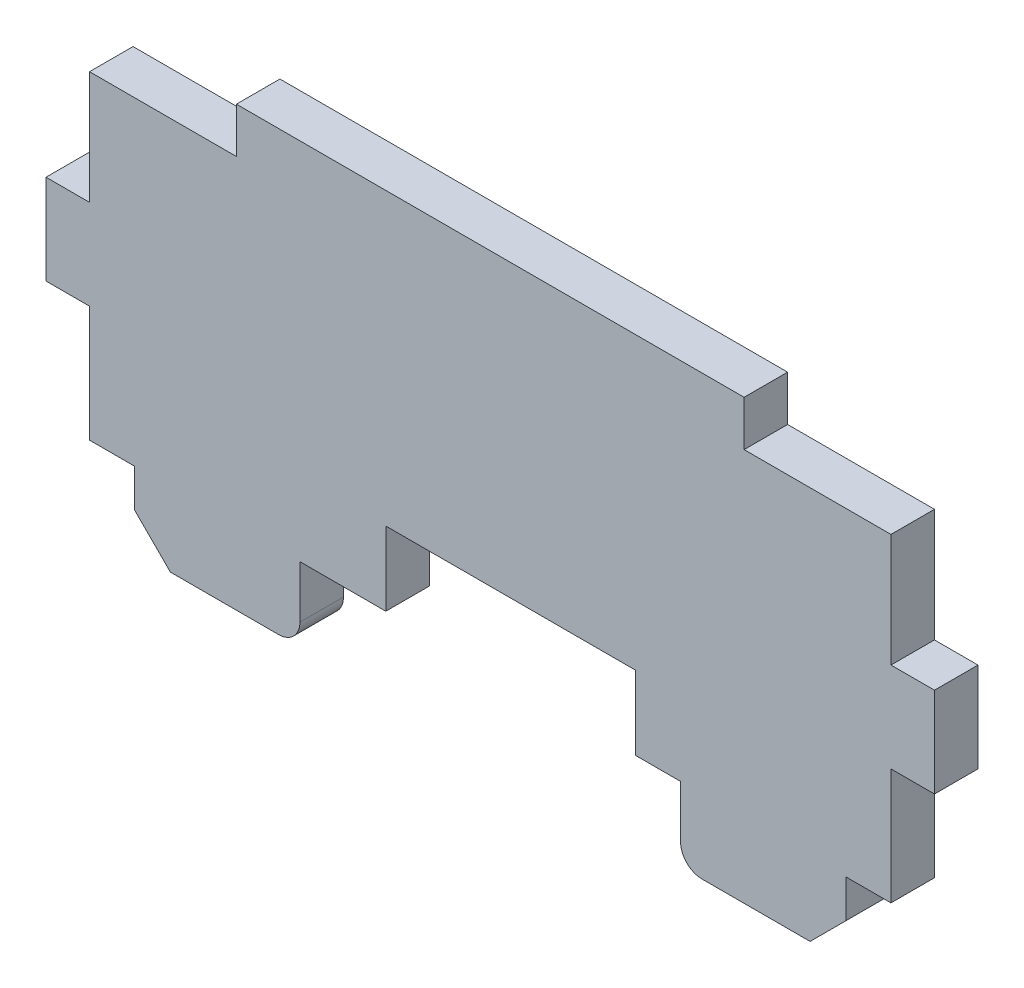
ISO-10303-21;
HEADER;
FILE_DESCRIPTION(('STEP AP214'),'2;1');
FILE_NAME('part.step','',(''),(''),'','','');
FILE_SCHEMA(('AUTOMOTIVE_DESIGN { 1 0 10303 214 1 1 1 1 }'));
ENDSEC;
DATA;
#1=APPLICATION_CONTEXT('core data for automotive mechanical design processes');
#2=APPLICATION_PROTOCOL_DEFINITION('international standard','automotive_design',2000,#1);
#3=PRODUCT_CONTEXT('',#1,'mechanical');
#4=PRODUCT('Part','Part','',(#3));
#5=PRODUCT_RELATED_PRODUCT_CATEGORY('part','',(#4));
#6=PRODUCT_DEFINITION_FORMATION('','',#4);
#7=PRODUCT_DEFINITION_CONTEXT('part definition',#1,'design');
#8=PRODUCT_DEFINITION('design','',#6,#7);
#9=PRODUCT_DEFINITION_SHAPE('','',#8);
#10=(LENGTH_UNIT() NAMED_UNIT(*) SI_UNIT(.MILLI.,.METRE.));
#11=(NAMED_UNIT(*) PLANE_ANGLE_UNIT() SI_UNIT($,.RADIAN.));
#12=(NAMED_UNIT(*) SI_UNIT($,.STERADIAN.) SOLID_ANGLE_UNIT());
#13=UNCERTAINTY_MEASURE_WITH_UNIT(LENGTH_MEASURE(1.E-05),#10,'distance_accuracy_value','');
#14=(GEOMETRIC_REPRESENTATION_CONTEXT(3) GLOBAL_UNCERTAINTY_ASSIGNED_CONTEXT((#13)) GLOBAL_UNIT_ASSIGNED_CONTEXT((#10,
#11,#12)) REPRESENTATION_CONTEXT('',''));
#15=CARTESIAN_POINT('',(0.,0.,0.));
#16=DIRECTION('',(0.,0.,1.));
#17=DIRECTION('',(1.,0.,0.));
#18=AXIS2_PLACEMENT_3D('',#15,#16,#17);
#19=CARTESIAN_POINT('',(56.016999457598,0.,3.048));
#20=DIRECTION('',(-1.,0.,0.));
#21=DIRECTION('',(0.,0.,1.));
#22=AXIS2_PLACEMENT_3D('',#19,#20,#21);
#23=PLANE('',#22);
#24=DIRECTION('',(0.,1.,0.));
#25=VECTOR('',#24,1.);
#26=CARTESIAN_POINT('',(56.016999457598,0.,0.));
#27=LINE('',#26,#25);
#28=CARTESIAN_POINT('',(56.016999457598,2.5,0.));
#29=VERTEX_POINT('',#28);
#30=CARTESIAN_POINT('',(56.016999457598,5.17,0.));
#31=VERTEX_POINT('',#30);
#32=EDGE_CURVE('E274',#29,#31,#27,.T.);
#33=ORIENTED_EDGE('',*,*,#32,.T.);
#34=DIRECTION('',(0.,0.,-1.));
#35=VECTOR('',#34,1.);
#36=CARTESIAN_POINT('',(56.016999457598,5.17,3.048));
#37=LINE('',#36,#35);
#38=CARTESIAN_POINT('',(56.016999457598,5.17,3.048));
#39=VERTEX_POINT('',#38);
#40=EDGE_CURVE('E11',#39,#31,#37,.T.);
#41=ORIENTED_EDGE('',*,*,#40,.F.);
#42=DIRECTION('',(0.,1.,0.));
#43=VECTOR('',#42,1.);
#44=CARTESIAN_POINT('',(56.016999457598,0.,3.048));
#45=LINE('',#44,#43);
#46=CARTESIAN_POINT('',(56.016999457598,2.5,3.048));
#47=VERTEX_POINT('',#46);
#48=EDGE_CURVE('E340',#47,#39,#45,.T.);
#49=ORIENTED_EDGE('',*,*,#48,.F.);
#50=DIRECTION('',(0.,0.,-1.));
#51=VECTOR('',#50,1.);
#52=CARTESIAN_POINT('',(56.016999457598,2.5,3.048));
#53=LINE('',#52,#51);
#54=EDGE_CURVE('E49',#47,#29,#53,.T.);
#55=ORIENTED_EDGE('',*,*,#54,.T.);
#56=EDGE_LOOP('',(#33,#41,#49,#55));
#57=FACE_BOUND('',#56,.T.);
#58=ADVANCED_FACE('F33',(#57),#23,.F.);
#59=CARTESIAN_POINT('',(0.,5.17,3.048));
#60=DIRECTION('',(0.,1.,0.));
#61=DIRECTION('',(0.,0.,1.));
#62=AXIS2_PLACEMENT_3D('',#59,#60,#61);
#63=PLANE('',#62);
#64=DIRECTION('',(1.,0.,0.));
#65=VECTOR('',#64,1.);
#66=CARTESIAN_POINT('',(0.,5.17,0.));
#67=LINE('',#66,#65);
#68=CARTESIAN_POINT('',(59.1819994151592,5.17,0.));
#69=VERTEX_POINT('',#68);
#70=EDGE_CURVE('E276',#31,#69,#67,.T.);
#71=ORIENTED_EDGE('',*,*,#70,.T.);
#72=DIRECTION('',(0.,0.,-1.));
#73=VECTOR('',#72,1.);
#74=CARTESIAN_POINT('',(59.1819994151592,5.17,3.048));
#75=LINE('',#74,#73);
#76=CARTESIAN_POINT('',(59.1819994151592,5.17,3.048));
#77=VERTEX_POINT('',#76);
#78=EDGE_CURVE('E41',#77,#69,#75,.T.);
#79=ORIENTED_EDGE('',*,*,#78,.F.);
#80=DIRECTION('',(1.,0.,0.));
#81=VECTOR('',#80,1.);
#82=CARTESIAN_POINT('',(0.,5.17,3.048));
#83=LINE('',#82,#81);
#84=EDGE_CURVE('E160',#39,#77,#83,.T.);
#85=ORIENTED_EDGE('',*,*,#84,.F.);
#86=ORIENTED_EDGE('',*,*,#40,.T.);
#87=EDGE_LOOP('',(#71,#79,#85,#86));
#88=FACE_BOUND('',#87,.T.);
#89=ADVANCED_FACE('F512',(#88),#63,.F.);
#90=CARTESIAN_POINT('',(59.1819994151592,0.,3.048));
#91=DIRECTION('',(-1.,0.,0.));
#92=DIRECTION('',(0.,0.,1.));
#93=AXIS2_PLACEMENT_3D('',#90,#91,#92);
#94=PLANE('',#93);
#95=DIRECTION('',(0.,1.,0.));
#96=VECTOR('',#95,1.);
#97=CARTESIAN_POINT('',(59.1819994151592,0.,0.));
#98=LINE('',#97,#96);
#99=CARTESIAN_POINT('',(59.1819994151592,13.2979997248203,0.));
#100=VERTEX_POINT('',#99);
#101=EDGE_CURVE('E278',#69,#100,#98,.T.);
#102=ORIENTED_EDGE('',*,*,#101,.T.);
#103=DIRECTION('',(0.,0.,-1.));
#104=VECTOR('',#103,1.);
#105=CARTESIAN_POINT('',(59.1819994151592,13.2979997248203,3.048));
#106=LINE('',#105,#104);
#107=CARTESIAN_POINT('',(59.1819994151592,13.2979997248203,3.048));
#108=VERTEX_POINT('',#107);
#109=EDGE_CURVE('E417',#108,#100,#106,.T.);
#110=ORIENTED_EDGE('',*,*,#109,.F.);
#111=DIRECTION('',(0.,1.,0.));
#112=VECTOR('',#111,1.);
#113=CARTESIAN_POINT('',(59.1819994151592,0.,3.048));
#114=LINE('',#113,#112);
#115=EDGE_CURVE('E425',#77,#108,#114,.T.);
#116=ORIENTED_EDGE('',*,*,#115,.F.);
#117=ORIENTED_EDGE('',*,*,#78,.T.);
#118=EDGE_LOOP('',(#102,#110,#116,#117));
#119=FACE_BOUND('',#118,.T.);
#120=ADVANCED_FACE('F423',(#119),#94,.F.);
#121=CARTESIAN_POINT('',(0.,13.2979997248203,3.048));
#122=DIRECTION('',(0.,1.,0.));
#123=DIRECTION('',(0.,0.,1.));
#124=AXIS2_PLACEMENT_3D('',#121,#122,#123);
#125=PLANE('',#124);
#126=DIRECTION('',(1.,0.,0.));
#127=VECTOR('',#126,1.);
#128=CARTESIAN_POINT('',(0.,13.2979997248203,0.));
#129=LINE('',#128,#127);
#130=CARTESIAN_POINT('',(62.2299993410707,13.2979997248203,0.));
#131=VERTEX_POINT('',#130);
#132=EDGE_CURVE('E280',#100,#131,#129,.T.);
#133=ORIENTED_EDGE('',*,*,#132,.T.);
#134=DIRECTION('',(0.,0.,-1.));
#135=VECTOR('',#134,1.);
#136=CARTESIAN_POINT('',(62.2299993410707,13.2979997248203,3.048));
#137=LINE('',#136,#135);
#138=CARTESIAN_POINT('',(62.2299993410707,13.2979997248203,3.048));
#139=VERTEX_POINT('',#138);
#140=EDGE_CURVE('E414',#139,#131,#137,.T.);
#141=ORIENTED_EDGE('',*,*,#140,.F.);
#142=DIRECTION('',(1.,0.,0.));
#143=VECTOR('',#142,1.);
#144=CARTESIAN_POINT('',(0.,13.2979997248203,3.048));
#145=LINE('',#144,#143);
#146=EDGE_CURVE('E442',#108,#139,#145,.T.);
#147=ORIENTED_EDGE('',*,*,#146,.F.);
#148=ORIENTED_EDGE('',*,*,#109,.T.);
#149=EDGE_LOOP('',(#133,#141,#147,#148));
#150=FACE_BOUND('',#149,.T.);
#151=ADVANCED_FACE('F433',(#150),#125,.F.);
#152=CARTESIAN_POINT('',(62.2299993410707,0.,3.048));
#153=DIRECTION('',(-1.,0.,0.));
#154=DIRECTION('',(0.,0.,1.));
#155=AXIS2_PLACEMENT_3D('',#152,#153,#154);
#156=PLANE('',#155);
#157=DIRECTION('',(0.,1.,0.));
#158=VECTOR('',#157,1.);
#159=CARTESIAN_POINT('',(62.2299993410707,0.,0.));
#160=LINE('',#159,#158);
#161=CARTESIAN_POINT('',(62.2299993410707,19.597199261263,0.));
#162=VERTEX_POINT('',#161);
#163=EDGE_CURVE('E282',#131,#162,#160,.T.);
#164=ORIENTED_EDGE('',*,*,#163,.T.);
#165=DIRECTION('',(0.,0.,-1.));
#166=VECTOR('',#165,1.);
#167=CARTESIAN_POINT('',(62.2299993410707,19.597199261263,3.048));
#168=LINE('',#167,#166);
#169=CARTESIAN_POINT('',(62.2299993410707,19.597199261263,3.048));
#170=VERTEX_POINT('',#169);
#171=EDGE_CURVE('E411',#170,#162,#168,.T.);
#172=ORIENTED_EDGE('',*,*,#171,.F.);
#173=DIRECTION('',(0.,1.,0.));
#174=VECTOR('',#173,1.);
#175=CARTESIAN_POINT('',(62.2299993410707,0.,3.048));
#176=LINE('',#175,#174);
#177=EDGE_CURVE('E439',#139,#170,#176,.T.);
#178=ORIENTED_EDGE('',*,*,#177,.F.);
#179=ORIENTED_EDGE('',*,*,#140,.T.);
#180=EDGE_LOOP('',(#164,#172,#178,#179));
#181=FACE_BOUND('',#180,.T.);
#182=ADVANCED_FACE('F437',(#181),#156,.F.);
#183=CARTESIAN_POINT('',(0.,19.597199261263,3.048));
#184=DIRECTION('',(0.,-1.,0.));
#185=DIRECTION('',(0.,0.,-1.));
#186=AXIS2_PLACEMENT_3D('',#183,#184,#185);
#187=PLANE('',#186);
#188=DIRECTION('',(-1.,0.,0.));
#189=VECTOR('',#188,1.);
#190=CARTESIAN_POINT('',(0.,19.597199261263,0.));
#191=LINE('',#190,#189);
#192=CARTESIAN_POINT('',(59.1819994151592,19.597199261263,0.));
#193=VERTEX_POINT('',#192);
#194=EDGE_CURVE('E284',#162,#193,#191,.T.);
#195=ORIENTED_EDGE('',*,*,#194,.T.);
#196=DIRECTION('',(0.,0.,-1.));
#197=VECTOR('',#196,1.);
#198=CARTESIAN_POINT('',(59.1819994151592,19.597199261263,3.048));
#199=LINE('',#198,#197);
#200=CARTESIAN_POINT('',(59.1819994151592,19.597199261263,3.048));
#201=VERTEX_POINT('',#200);
#202=EDGE_CURVE('E408',#201,#193,#199,.T.);
#203=ORIENTED_EDGE('',*,*,#202,.F.);
#204=DIRECTION('',(-1.,0.,0.));
#205=VECTOR('',#204,1.);
#206=CARTESIAN_POINT('',(0.,19.597199261263,3.048));
#207=LINE('',#206,#205);
#208=EDGE_CURVE('E441',#170,#201,#207,.T.);
#209=ORIENTED_EDGE('',*,*,#208,.F.);
#210=ORIENTED_EDGE('',*,*,#171,.T.);
#211=EDGE_LOOP('',(#195,#203,#209,#210));
#212=FACE_BOUND('',#211,.T.);
#213=ADVANCED_FACE('F528',(#212),#187,.F.);
#214=CARTESIAN_POINT('',(59.1819994151592,0.,3.048));
#215=DIRECTION('',(-1.,0.,0.));
#216=DIRECTION('',(0.,0.,1.));
#217=AXIS2_PLACEMENT_3D('',#214,#215,#216);
#218=PLANE('',#217);
#219=DIRECTION('',(0.,1.,0.));
#220=VECTOR('',#219,1.);
#221=CARTESIAN_POINT('',(59.1819994151592,0.,0.));
#222=LINE('',#221,#220);
#223=CARTESIAN_POINT('',(59.1819994151592,27.5219999999553,0.));
#224=VERTEX_POINT('',#223);
#225=EDGE_CURVE('E286',#193,#224,#222,.T.);
#226=ORIENTED_EDGE('',*,*,#225,.T.);
#227=DIRECTION('',(0.,0.,-1.));
#228=VECTOR('',#227,1.);
#229=CARTESIAN_POINT('',(59.1819994151592,27.5219999999553,3.048));
#230=LINE('',#229,#228);
#231=CARTESIAN_POINT('',(59.1819994151592,27.5219999999553,3.048));
#232=VERTEX_POINT('',#231);
#233=EDGE_CURVE('E405',#232,#224,#230,.T.);
#234=ORIENTED_EDGE('',*,*,#233,.F.);
#235=DIRECTION('',(0.,1.,0.));
#236=VECTOR('',#235,1.);
#237=CARTESIAN_POINT('',(59.1819994151592,0.,3.048));
#238=LINE('',#237,#236);
#239=EDGE_CURVE('E444',#201,#232,#238,.T.);
#240=ORIENTED_EDGE('',*,*,#239,.F.);
#241=ORIENTED_EDGE('',*,*,#202,.T.);
#242=EDGE_LOOP('',(#226,#234,#240,#241));
#243=FACE_BOUND('',#242,.T.);
#244=ADVANCED_FACE('F531',(#243),#218,.F.);
#245=CARTESIAN_POINT('',(0.,27.5219999999553,3.048));
#246=DIRECTION('',(0.,-1.,0.));
#247=DIRECTION('',(0.,0.,-1.));
#248=AXIS2_PLACEMENT_3D('',#245,#246,#247);
#249=PLANE('',#248);
#250=DIRECTION('',(-1.,0.,0.));
#251=VECTOR('',#250,1.);
#252=CARTESIAN_POINT('',(0.,27.5219999999553,0.));
#253=LINE('',#252,#251);
#254=CARTESIAN_POINT('',(48.8949995487928,27.5219999999553,0.));
#255=VERTEX_POINT('',#254);
#256=EDGE_CURVE('E288',#224,#255,#253,.T.);
#257=ORIENTED_EDGE('',*,*,#256,.T.);
#258=DIRECTION('',(0.,0.,-1.));
#259=VECTOR('',#258,1.);
#260=CARTESIAN_POINT('',(48.8949995487928,27.5219999999553,3.048));
#261=LINE('',#260,#259);
#262=CARTESIAN_POINT('',(48.8949995487928,27.5219999999553,3.048));
#263=VERTEX_POINT('',#262);
#264=EDGE_CURVE('E402',#263,#255,#261,.T.);
#265=ORIENTED_EDGE('',*,*,#264,.F.);
#266=DIRECTION('',(-1.,0.,0.));
#267=VECTOR('',#266,1.);
#268=CARTESIAN_POINT('',(0.,27.5219999999553,3.048));
#269=LINE('',#268,#267);
#270=EDGE_CURVE('E450',#232,#263,#269,.T.);
#271=ORIENTED_EDGE('',*,*,#270,.F.);
#272=ORIENTED_EDGE('',*,*,#233,.T.);
#273=EDGE_LOOP('',(#257,#265,#271,#272));
#274=FACE_BOUND('',#273,.T.);
#275=ADVANCED_FACE('F535',(#274),#249,.F.);
#276=CARTESIAN_POINT('',(48.8949995487928,0.,3.048));
#277=DIRECTION('',(-1.,0.,0.));
#278=DIRECTION('',(0.,0.,1.));
#279=AXIS2_PLACEMENT_3D('',#276,#277,#278);
#280=PLANE('',#279);
#281=DIRECTION('',(0.,1.,0.));
#282=VECTOR('',#281,1.);
#283=CARTESIAN_POINT('',(48.8949995487928,0.,0.));
#284=LINE('',#283,#282);
#285=CARTESIAN_POINT('',(48.8949995487928,30.6969997287542,0.));
#286=VERTEX_POINT('',#285);
#287=EDGE_CURVE('E290',#255,#286,#284,.T.);
#288=ORIENTED_EDGE('',*,*,#287,.T.);
#289=DIRECTION('',(0.,0.,-1.));
#290=VECTOR('',#289,1.);
#291=CARTESIAN_POINT('',(48.8949995487928,30.6969997287542,3.048));
#292=LINE('',#291,#290);
#293=CARTESIAN_POINT('',(48.8949995487928,30.6969997287542,3.048));
#294=VERTEX_POINT('',#293);
#295=EDGE_CURVE('E399',#294,#286,#292,.T.);
#296=ORIENTED_EDGE('',*,*,#295,.F.);
#297=DIRECTION('',(0.,1.,0.));
#298=VECTOR('',#297,1.);
#299=CARTESIAN_POINT('',(48.8949995487928,0.,3.048));
#300=LINE('',#299,#298);
#301=EDGE_CURVE('E452',#263,#294,#300,.T.);
#302=ORIENTED_EDGE('',*,*,#301,.F.);
#303=ORIENTED_EDGE('',*,*,#264,.T.);
#304=EDGE_LOOP('',(#288,#296,#302,#303));
#305=FACE_BOUND('',#304,.T.);
#306=ADVANCED_FACE('F539',(#305),#280,.F.);
#307=CARTESIAN_POINT('',(0.,30.6969997287542,3.048));
#308=DIRECTION('',(0.,-1.,0.));
#309=DIRECTION('',(0.,0.,-1.));
#310=AXIS2_PLACEMENT_3D('',#307,#308,#309);
#311=PLANE('',#310);
#312=DIRECTION('',(-1.,0.,0.));
#313=VECTOR('',#312,1.);
#314=CARTESIAN_POINT('',(0.,30.6969997287542,0.));
#315=LINE('',#314,#313);
#316=CARTESIAN_POINT('',(13.3350007236004,30.6969997287542,0.));
#317=VERTEX_POINT('',#316);
#318=EDGE_CURVE('E292',#286,#317,#315,.T.);
#319=ORIENTED_EDGE('',*,*,#318,.T.);
#320=DIRECTION('',(0.,0.,-1.));
#321=VECTOR('',#320,1.);
#322=CARTESIAN_POINT('',(13.3350007236004,30.6969997287542,3.048));
#323=LINE('',#322,#321);
#324=CARTESIAN_POINT('',(13.3350007236004,30.6969997287542,3.048));
#325=VERTEX_POINT('',#324);
#326=EDGE_CURVE('E396',#325,#317,#323,.T.);
#327=ORIENTED_EDGE('',*,*,#326,.F.);
#328=DIRECTION('',(-1.,0.,0.));
#329=VECTOR('',#328,1.);
#330=CARTESIAN_POINT('',(0.,30.6969997287542,3.048));
#331=LINE('',#330,#329);
#332=EDGE_CURVE('E454',#294,#325,#331,.T.);
#333=ORIENTED_EDGE('',*,*,#332,.F.);
#334=ORIENTED_EDGE('',*,*,#295,.T.);
#335=EDGE_LOOP('',(#319,#327,#333,#334));
#336=FACE_BOUND('',#335,.T.);
#337=ADVANCED_FACE('F543',(#336),#311,.F.);
#338=CARTESIAN_POINT('',(13.3350007236004,0.,3.048));
#339=DIRECTION('',(1.,0.,0.));
#340=DIRECTION('',(0.,0.,-1.));
#341=AXIS2_PLACEMENT_3D('',#338,#339,#340);
#342=PLANE('',#341);
#343=DIRECTION('',(0.,-1.,0.));
#344=VECTOR('',#343,1.);
#345=CARTESIAN_POINT('',(13.3350007236004,0.,0.));
#346=LINE('',#345,#344);
#347=CARTESIAN_POINT('',(13.3350007236004,27.5219999999553,0.));
#348=VERTEX_POINT('',#347);
#349=EDGE_CURVE('E294',#317,#348,#346,.T.);
#350=ORIENTED_EDGE('',*,*,#349,.T.);
#351=DIRECTION('',(0.,0.,-1.));
#352=VECTOR('',#351,1.);
#353=CARTESIAN_POINT('',(13.3350007236004,27.5219999999553,3.048));
#354=LINE('',#353,#352);
#355=CARTESIAN_POINT('',(13.3350007236004,27.5219999999553,3.048));
#356=VERTEX_POINT('',#355);
#357=EDGE_CURVE('E393',#356,#348,#354,.T.);
#358=ORIENTED_EDGE('',*,*,#357,.F.);
#359=DIRECTION('',(0.,-1.,0.));
#360=VECTOR('',#359,1.);
#361=CARTESIAN_POINT('',(13.3350007236004,0.,3.048));
#362=LINE('',#361,#360);
#363=EDGE_CURVE('E456',#325,#356,#362,.T.);
#364=ORIENTED_EDGE('',*,*,#363,.F.);
#365=ORIENTED_EDGE('',*,*,#326,.T.);
#366=EDGE_LOOP('',(#350,#358,#364,#365));
#367=FACE_BOUND('',#366,.T.);
#368=ADVANCED_FACE('F547',(#367),#342,.F.);
#369=CARTESIAN_POINT('',(0.,27.5219999999553,3.048));
#370=DIRECTION('',(0.,-1.,0.));
#371=DIRECTION('',(0.,0.,-1.));
#372=AXIS2_PLACEMENT_3D('',#369,#370,#371);
#373=PLANE('',#372);
#374=DIRECTION('',(-1.,0.,0.));
#375=VECTOR('',#374,1.);
#376=CARTESIAN_POINT('',(0.,27.5219999999553,0.));
#377=LINE('',#376,#375);
#378=CARTESIAN_POINT('',(3.04799899458885,27.5219999999553,0.));
#379=VERTEX_POINT('',#378);
#380=EDGE_CURVE('E296',#348,#379,#377,.T.);
#381=ORIENTED_EDGE('',*,*,#380,.T.);
#382=DIRECTION('',(0.,0.,-1.));
#383=VECTOR('',#382,1.);
#384=CARTESIAN_POINT('',(3.04799899458885,27.5219999999553,3.048));
#385=LINE('',#384,#383);
#386=CARTESIAN_POINT('',(3.04799899458885,27.5219999999553,3.048));
#387=VERTEX_POINT('',#386);
#388=EDGE_CURVE('E390',#387,#379,#385,.T.);
#389=ORIENTED_EDGE('',*,*,#388,.F.);
#390=DIRECTION('',(-1.,0.,0.));
#391=VECTOR('',#390,1.);
#392=CARTESIAN_POINT('',(0.,27.5219999999553,3.048));
#393=LINE('',#392,#391);
#394=EDGE_CURVE('E458',#356,#387,#393,.T.);
#395=ORIENTED_EDGE('',*,*,#394,.F.);
#396=ORIENTED_EDGE('',*,*,#357,.T.);
#397=EDGE_LOOP('',(#381,#389,#395,#396));
#398=FACE_BOUND('',#397,.T.);
#399=ADVANCED_FACE('F551',(#398),#373,.F.);
#400=CARTESIAN_POINT('',(3.04799899458885,0.,3.048));
#401=DIRECTION('',(1.,0.,0.));
#402=DIRECTION('',(0.,0.,-1.));
#403=AXIS2_PLACEMENT_3D('',#400,#401,#402);
#404=PLANE('',#403);
#405=DIRECTION('',(0.,-1.,0.));
#406=VECTOR('',#405,1.);
#407=CARTESIAN_POINT('',(3.04799899458885,0.,0.));
#408=LINE('',#407,#406);
#409=CARTESIAN_POINT('',(3.04799899458885,19.597199261263,0.));
#410=VERTEX_POINT('',#409);
#411=EDGE_CURVE('E298',#379,#410,#408,.T.);
#412=ORIENTED_EDGE('',*,*,#411,.T.);
#413=DIRECTION('',(0.,0.,-1.));
#414=VECTOR('',#413,1.);
#415=CARTESIAN_POINT('',(3.04799899458885,19.597199261263,3.048));
#416=LINE('',#415,#414);
#417=CARTESIAN_POINT('',(3.04799899458885,19.597199261263,3.048));
#418=VERTEX_POINT('',#417);
#419=EDGE_CURVE('E387',#418,#410,#416,.T.);
#420=ORIENTED_EDGE('',*,*,#419,.F.);
#421=DIRECTION('',(0.,-1.,0.));
#422=VECTOR('',#421,1.);
#423=CARTESIAN_POINT('',(3.04799899458885,0.,3.048));
#424=LINE('',#423,#422);
#425=EDGE_CURVE('E460',#387,#418,#424,.T.);
#426=ORIENTED_EDGE('',*,*,#425,.F.);
#427=ORIENTED_EDGE('',*,*,#388,.T.);
#428=EDGE_LOOP('',(#412,#420,#426,#427));
#429=FACE_BOUND('',#428,.T.);
#430=ADVANCED_FACE('F555',(#429),#404,.F.);
#431=CARTESIAN_POINT('',(0.,19.597199261263,3.048));
#432=DIRECTION('',(0.,-1.,0.));
#433=DIRECTION('',(0.,0.,-1.));
#434=AXIS2_PLACEMENT_3D('',#431,#432,#433);
#435=PLANE('',#434);
#436=DIRECTION('',(-1.,0.,0.));
#437=VECTOR('',#436,1.);
#438=CARTESIAN_POINT('',(0.,19.597199261263,0.));
#439=LINE('',#438,#437);
#440=CARTESIAN_POINT('',(0.,19.597199261263,0.));
#441=VERTEX_POINT('',#440);
#442=EDGE_CURVE('E300',#410,#441,#439,.T.);
#443=ORIENTED_EDGE('',*,*,#442,.T.);
#444=DIRECTION('',(0.,0.,-1.));
#445=VECTOR('',#444,1.);
#446=CARTESIAN_POINT('',(0.,19.597199261263,3.048));
#447=LINE('',#446,#445);
#448=CARTESIAN_POINT('',(0.,19.597199261263,3.048));
#449=VERTEX_POINT('',#448);
#450=EDGE_CURVE('E384',#449,#441,#447,.T.);
#451=ORIENTED_EDGE('',*,*,#450,.F.);
#452=DIRECTION('',(-1.,0.,0.));
#453=VECTOR('',#452,1.);
#454=CARTESIAN_POINT('',(0.,19.597199261263,3.048));
#455=LINE('',#454,#453);
#456=EDGE_CURVE('E462',#418,#449,#455,.T.);
#457=ORIENTED_EDGE('',*,*,#456,.F.);
#458=ORIENTED_EDGE('',*,*,#419,.T.);
#459=EDGE_LOOP('',(#443,#451,#457,#458));
#460=FACE_BOUND('',#459,.T.);
#461=ADVANCED_FACE('F559',(#460),#435,.F.);
#462=CARTESIAN_POINT('',(0.,0.,3.048));
#463=DIRECTION('',(1.,0.,0.));
#464=DIRECTION('',(0.,0.,-1.));
#465=AXIS2_PLACEMENT_3D('',#462,#463,#464);
#466=PLANE('',#465);
#467=DIRECTION('',(0.,-1.,0.));
#468=VECTOR('',#467,1.);
#469=CARTESIAN_POINT('',(0.,0.,0.));
#470=LINE('',#469,#468);
#471=CARTESIAN_POINT('',(0.,13.2979997248203,0.));
#472=VERTEX_POINT('',#471);
#473=EDGE_CURVE('E302',#441,#472,#470,.T.);
#474=ORIENTED_EDGE('',*,*,#473,.T.);
#475=DIRECTION('',(0.,0.,-1.));
#476=VECTOR('',#475,1.);
#477=CARTESIAN_POINT('',(0.,13.2979997248203,3.048));
#478=LINE('',#477,#476);
#479=CARTESIAN_POINT('',(0.,13.2979997248203,3.048));
#480=VERTEX_POINT('',#479);
#481=EDGE_CURVE('E381',#480,#472,#478,.T.);
#482=ORIENTED_EDGE('',*,*,#481,.F.);
#483=DIRECTION('',(0.,-1.,0.));
#484=VECTOR('',#483,1.);
#485=CARTESIAN_POINT('',(0.,0.,3.048));
#486=LINE('',#485,#484);
#487=EDGE_CURVE('E464',#449,#480,#486,.T.);
#488=ORIENTED_EDGE('',*,*,#487,.F.);
#489=ORIENTED_EDGE('',*,*,#450,.T.);
#490=EDGE_LOOP('',(#474,#482,#488,#489));
#491=FACE_BOUND('',#490,.T.);
#492=ADVANCED_FACE('F563',(#491),#466,.F.);
#493=CARTESIAN_POINT('',(0.,13.2979997248203,3.048));
#494=DIRECTION('',(0.,1.,0.));
#495=DIRECTION('',(0.,0.,1.));
#496=AXIS2_PLACEMENT_3D('',#493,#494,#495);
#497=PLANE('',#496);
#498=DIRECTION('',(1.,0.,0.));
#499=VECTOR('',#498,1.);
#500=CARTESIAN_POINT('',(0.,13.2979997248203,0.));
#501=LINE('',#500,#499);
#502=CARTESIAN_POINT('',(3.04799899458885,13.2979997248203,0.));
#503=VERTEX_POINT('',#502);
#504=EDGE_CURVE('E304',#472,#503,#501,.T.);
#505=ORIENTED_EDGE('',*,*,#504,.T.);
#506=DIRECTION('',(0.,0.,-1.));
#507=VECTOR('',#506,1.);
#508=CARTESIAN_POINT('',(3.04799899458885,13.2979997248203,3.048));
#509=LINE('',#508,#507);
#510=CARTESIAN_POINT('',(3.04799899458885,13.2979997248203,3.048));
#511=VERTEX_POINT('',#510);
#512=EDGE_CURVE('E378',#511,#503,#509,.T.);
#513=ORIENTED_EDGE('',*,*,#512,.F.);
#514=DIRECTION('',(1.,0.,0.));
#515=VECTOR('',#514,1.);
#516=CARTESIAN_POINT('',(0.,13.2979997248203,3.048));
#517=LINE('',#516,#515);
#518=EDGE_CURVE('E466',#480,#511,#517,.T.);
#519=ORIENTED_EDGE('',*,*,#518,.F.);
#520=ORIENTED_EDGE('',*,*,#481,.T.);
#521=EDGE_LOOP('',(#505,#513,#519,#520));
#522=FACE_BOUND('',#521,.T.);
#523=ADVANCED_FACE('F567',(#522),#497,.F.);
#524=CARTESIAN_POINT('',(3.04799899458885,0.,3.048));
#525=DIRECTION('',(1.,0.,0.));
#526=DIRECTION('',(0.,0.,-1.));
#527=AXIS2_PLACEMENT_3D('',#524,#525,#526);
#528=PLANE('',#527);
#529=DIRECTION('',(0.,-1.,0.));
#530=VECTOR('',#529,1.);
#531=CARTESIAN_POINT('',(3.04799899458885,0.,0.));
#532=LINE('',#531,#530);
#533=CARTESIAN_POINT('',(3.04799899458885,5.17,0.));
#534=VERTEX_POINT('',#533);
#535=EDGE_CURVE('E306',#503,#534,#532,.T.);
#536=ORIENTED_EDGE('',*,*,#535,.T.);
#537=DIRECTION('',(0.,0.,-1.));
#538=VECTOR('',#537,1.);
#539=CARTESIAN_POINT('',(3.04799899458885,5.17,3.048));
#540=LINE('',#539,#538);
#541=CARTESIAN_POINT('',(3.04799899458885,5.17,3.048));
#542=VERTEX_POINT('',#541);
#543=EDGE_CURVE('E375',#542,#534,#540,.T.);
#544=ORIENTED_EDGE('',*,*,#543,.F.);
#545=DIRECTION('',(0.,-1.,0.));
#546=VECTOR('',#545,1.);
#547=CARTESIAN_POINT('',(3.04799899458885,0.,3.048));
#548=LINE('',#547,#546);
#549=EDGE_CURVE('E468',#511,#542,#548,.T.);
#550=ORIENTED_EDGE('',*,*,#549,.F.);
#551=ORIENTED_EDGE('',*,*,#512,.T.);
#552=EDGE_LOOP('',(#536,#544,#550,#551));
#553=FACE_BOUND('',#552,.T.);
#554=ADVANCED_FACE('F571',(#553),#528,.F.);
#555=CARTESIAN_POINT('',(0.,5.17,3.048));
#556=DIRECTION('',(0.,1.,0.));
#557=DIRECTION('',(0.,0.,1.));
#558=AXIS2_PLACEMENT_3D('',#555,#556,#557);
#559=PLANE('',#558);
#560=DIRECTION('',(1.,0.,0.));
#561=VECTOR('',#560,1.);
#562=CARTESIAN_POINT('',(0.,5.17,0.));
#563=LINE('',#562,#561);
#564=CARTESIAN_POINT('',(6.212999379553,5.17,0.));
#565=VERTEX_POINT('',#564);
#566=EDGE_CURVE('E308',#534,#565,#563,.T.);
#567=ORIENTED_EDGE('',*,*,#566,.T.);
#568=DIRECTION('',(0.,0.,-1.));
#569=VECTOR('',#568,1.);
#570=CARTESIAN_POINT('',(6.212999379553,5.17,3.048));
#571=LINE('',#570,#569);
#572=CARTESIAN_POINT('',(6.212999379553,5.17,3.048));
#573=VERTEX_POINT('',#572);
#574=EDGE_CURVE('E372',#573,#565,#571,.T.);
#575=ORIENTED_EDGE('',*,*,#574,.F.);
#576=DIRECTION('',(1.,0.,0.));
#577=VECTOR('',#576,1.);
#578=CARTESIAN_POINT('',(0.,5.17,3.048));
#579=LINE('',#578,#577);
#580=EDGE_CURVE('E470',#542,#573,#579,.T.);
#581=ORIENTED_EDGE('',*,*,#580,.F.);
#582=ORIENTED_EDGE('',*,*,#543,.T.);
#583=EDGE_LOOP('',(#567,#575,#581,#582));
#584=FACE_BOUND('',#583,.T.);
#585=ADVANCED_FACE('F575',(#584),#559,.F.);
#586=CARTESIAN_POINT('',(6.212999379553,0.,3.048));
#587=DIRECTION('',(1.,0.,0.));
#588=DIRECTION('',(0.,0.,-1.));
#589=AXIS2_PLACEMENT_3D('',#586,#587,#588);
#590=PLANE('',#589);
#591=DIRECTION('',(0.,-1.,0.));
#592=VECTOR('',#591,1.);
#593=CARTESIAN_POINT('',(6.212999379553,0.,0.));
#594=LINE('',#593,#592);
#595=CARTESIAN_POINT('',(6.212999379553,2.50000000000006,0.));
#596=VERTEX_POINT('',#595);
#597=EDGE_CURVE('E310',#565,#596,#594,.T.);
#598=ORIENTED_EDGE('',*,*,#597,.T.);
#599=DIRECTION('',(0.,0.,-1.));
#600=VECTOR('',#599,1.);
#601=CARTESIAN_POINT('',(6.212999379553,2.50000000000006,3.048));
#602=LINE('',#601,#600);
#603=CARTESIAN_POINT('',(6.212999379553,2.50000000000006,3.048));
#604=VERTEX_POINT('',#603);
#605=EDGE_CURVE('E369',#604,#596,#602,.T.);
#606=ORIENTED_EDGE('',*,*,#605,.F.);
#607=DIRECTION('',(0.,-1.,0.));
#608=VECTOR('',#607,1.);
#609=CARTESIAN_POINT('',(6.212999379553,0.,3.048));
#610=LINE('',#609,#608);
#611=EDGE_CURVE('E472',#573,#604,#610,.T.);
#612=ORIENTED_EDGE('',*,*,#611,.F.);
#613=ORIENTED_EDGE('',*,*,#574,.T.);
#614=EDGE_LOOP('',(#598,#606,#612,#613));
#615=FACE_BOUND('',#614,.T.);
#616=ADVANCED_FACE('F579',(#615),#590,.F.);
#617=CARTESIAN_POINT('',(4.35649968977653,4.35649968977653,3.048));
#618=DIRECTION('',(0.707106781186547,0.707106781186547,0.));
#619=DIRECTION('',(-0.707106781186548,0.707106781186548,0.));
#620=AXIS2_PLACEMENT_3D('',#617,#618,#619);
#621=PLANE('',#620);
#622=DIRECTION('',(0.707106781186548,-0.707106781186548,0.));
#623=VECTOR('',#622,1.);
#624=CARTESIAN_POINT('',(4.35649968977653,4.35649968977653,0.));
#625=LINE('',#624,#623);
#626=CARTESIAN_POINT('',(8.71299937955305,0.,0.));
#627=VERTEX_POINT('',#626);
#628=EDGE_CURVE('E312',#596,#627,#625,.T.);
#629=ORIENTED_EDGE('',*,*,#628,.T.);
#630=DIRECTION('',(0.,0.,-1.));
#631=VECTOR('',#630,1.);
#632=CARTESIAN_POINT('',(8.71299937955305,0.,3.048));
#633=LINE('',#632,#631);
#634=CARTESIAN_POINT('',(8.71299937955305,0.,3.048));
#635=VERTEX_POINT('',#634);
#636=EDGE_CURVE('E366',#635,#627,#633,.T.);
#637=ORIENTED_EDGE('',*,*,#636,.F.);
#638=DIRECTION('',(0.707106781186548,-0.707106781186548,0.));
#639=VECTOR('',#638,1.);
#640=CARTESIAN_POINT('',(4.35649968977653,4.35649968977653,3.048));
#641=LINE('',#640,#639);
#642=EDGE_CURVE('E474',#604,#635,#641,.T.);
#643=ORIENTED_EDGE('',*,*,#642,.F.);
#644=ORIENTED_EDGE('',*,*,#605,.T.);
#645=EDGE_LOOP('',(#629,#637,#643,#644));
#646=FACE_BOUND('',#645,.T.);
#647=ADVANCED_FACE('F583',(#646),#621,.F.);
#648=CARTESIAN_POINT('',(0.,0.,3.048));
#649=DIRECTION('',(0.,1.,0.));
#650=DIRECTION('',(0.,0.,1.));
#651=AXIS2_PLACEMENT_3D('',#648,#649,#650);
#652=PLANE('',#651);
#653=DIRECTION('',(1.,0.,0.));
#654=VECTOR('',#653,1.);
#655=CARTESIAN_POINT('',(0.,0.,0.));
#656=LINE('',#655,#654);
#657=CARTESIAN_POINT('',(16.2849993795532,0.,0.));
#658=VERTEX_POINT('',#657);
#659=EDGE_CURVE('E314',#627,#658,#656,.T.);
#660=ORIENTED_EDGE('',*,*,#659,.T.);
#661=DIRECTION('',(0.,0.,-1.));
#662=VECTOR('',#661,1.);
#663=CARTESIAN_POINT('',(16.2849993795532,0.,3.048));
#664=LINE('',#663,#662);
#665=CARTESIAN_POINT('',(16.2849993795532,0.,3.048));
#666=VERTEX_POINT('',#665);
#667=EDGE_CURVE('E363',#666,#658,#664,.T.);
#668=ORIENTED_EDGE('',*,*,#667,.F.);
#669=DIRECTION('',(1.,0.,0.));
#670=VECTOR('',#669,1.);
#671=CARTESIAN_POINT('',(0.,0.,3.048));
#672=LINE('',#671,#670);
#673=EDGE_CURVE('E476',#635,#666,#672,.T.);
#674=ORIENTED_EDGE('',*,*,#673,.F.);
#675=ORIENTED_EDGE('',*,*,#636,.T.);
#676=EDGE_LOOP('',(#660,#668,#674,#675));
#677=FACE_BOUND('',#676,.T.);
#678=ADVANCED_FACE('F587',(#677),#652,.F.);
#679=CARTESIAN_POINT('',(16.2849993795532,1.5,3.048));
#680=DIRECTION('',(0.,0.,-1.));
#681=DIRECTION('',(-1.,0.,0.));
#682=AXIS2_PLACEMENT_3D('',#679,#680,#681);
#683=CYLINDRICAL_SURFACE('',#682,1.5);
#684=CARTESIAN_POINT('',(16.2849993795532,1.5,0.));
#685=DIRECTION('',(0.,0.,1.));
#686=DIRECTION('',(1.,0.,0.));
#687=AXIS2_PLACEMENT_3D('',#684,#685,#686);
#688=CIRCLE('',#687,1.5);
#689=CARTESIAN_POINT('',(17.7849993795532,1.5,0.));
#690=VERTEX_POINT('',#689);
#691=EDGE_CURVE('E316',#658,#690,#688,.T.);
#692=ORIENTED_EDGE('',*,*,#691,.T.);
#693=DIRECTION('',(0.,0.,-1.));
#694=VECTOR('',#693,1.);
#695=CARTESIAN_POINT('',(17.7849993795532,1.5,3.048));
#696=LINE('',#695,#694);
#697=CARTESIAN_POINT('',(17.7849993795532,1.5,3.048));
#698=VERTEX_POINT('',#697);
#699=EDGE_CURVE('E360',#698,#690,#696,.T.);
#700=ORIENTED_EDGE('',*,*,#699,.F.);
#701=CARTESIAN_POINT('',(16.2849993795532,1.5,3.048));
#702=DIRECTION('',(0.,0.,1.));
#703=DIRECTION('',(1.,0.,0.));
#704=AXIS2_PLACEMENT_3D('',#701,#702,#703);
#705=CIRCLE('',#704,1.5);
#706=EDGE_CURVE('E478',#666,#698,#705,.T.);
#707=ORIENTED_EDGE('',*,*,#706,.F.);
#708=ORIENTED_EDGE('',*,*,#667,.T.);
#709=EDGE_LOOP('',(#692,#700,#707,#708));
#710=FACE_BOUND('',#709,.T.);
#711=ADVANCED_FACE('F591',(#710),#683,.T.);
#712=CARTESIAN_POINT('',(17.7849993795532,0.,3.048));
#713=DIRECTION('',(-1.,0.,0.));
#714=DIRECTION('',(0.,0.,1.));
#715=AXIS2_PLACEMENT_3D('',#712,#713,#714);
#716=PLANE('',#715);
#717=DIRECTION('',(0.,1.,0.));
#718=VECTOR('',#717,1.);
#719=CARTESIAN_POINT('',(17.7849993795532,0.,0.));
#720=LINE('',#719,#718);
#721=CARTESIAN_POINT('',(17.7849993795532,5.17,0.));
#722=VERTEX_POINT('',#721);
#723=EDGE_CURVE('E318',#690,#722,#720,.T.);
#724=ORIENTED_EDGE('',*,*,#723,.T.);
#725=DIRECTION('',(0.,0.,-1.));
#726=VECTOR('',#725,1.);
#727=CARTESIAN_POINT('',(17.7849993795532,5.17,3.048));
#728=LINE('',#727,#726);
#729=CARTESIAN_POINT('',(17.7849993795532,5.17,3.048));
#730=VERTEX_POINT('',#729);
#731=EDGE_CURVE('E357',#730,#722,#728,.T.);
#732=ORIENTED_EDGE('',*,*,#731,.F.);
#733=DIRECTION('',(0.,1.,0.));
#734=VECTOR('',#733,1.);
#735=CARTESIAN_POINT('',(17.7849993795532,0.,3.048));
#736=LINE('',#735,#734);
#737=EDGE_CURVE('E480',#698,#730,#736,.T.);
#738=ORIENTED_EDGE('',*,*,#737,.F.);
#739=ORIENTED_EDGE('',*,*,#699,.T.);
#740=EDGE_LOOP('',(#724,#732,#738,#739));
#741=FACE_BOUND('',#740,.T.);
#742=ADVANCED_FACE('F595',(#741),#716,.F.);
#743=CARTESIAN_POINT('',(0.,5.17,3.048));
#744=DIRECTION('',(0.,1.,0.));
#745=DIRECTION('',(0.,0.,1.));
#746=AXIS2_PLACEMENT_3D('',#743,#744,#745);
#747=PLANE('',#746);
#748=DIRECTION('',(1.,0.,0.));
#749=VECTOR('',#748,1.);
#750=CARTESIAN_POINT('',(0.,5.17,0.));
#751=LINE('',#750,#749);
#752=CARTESIAN_POINT('',(23.7997994575978,5.17,0.));
#753=VERTEX_POINT('',#752);
#754=EDGE_CURVE('E320',#722,#753,#751,.T.);
#755=ORIENTED_EDGE('',*,*,#754,.T.);
#756=DIRECTION('',(0.,0.,-1.));
#757=VECTOR('',#756,1.);
#758=CARTESIAN_POINT('',(23.7997994575978,5.17,3.048));
#759=LINE('',#758,#757);
#760=CARTESIAN_POINT('',(23.7997994575978,5.17,3.048));
#761=VERTEX_POINT('',#760);
#762=EDGE_CURVE('E354',#761,#753,#759,.T.);
#763=ORIENTED_EDGE('',*,*,#762,.F.);
#764=DIRECTION('',(1.,0.,0.));
#765=VECTOR('',#764,1.);
#766=CARTESIAN_POINT('',(0.,5.17,3.048));
#767=LINE('',#766,#765);
#768=EDGE_CURVE('E482',#730,#761,#767,.T.);
#769=ORIENTED_EDGE('',*,*,#768,.F.);
#770=ORIENTED_EDGE('',*,*,#731,.T.);
#771=EDGE_LOOP('',(#755,#763,#769,#770));
#772=FACE_BOUND('',#771,.T.);
#773=ADVANCED_FACE('F599',(#772),#747,.F.);
#774=CARTESIAN_POINT('',(23.7997994575978,0.,3.048));
#775=DIRECTION('',(-1.,0.,0.));
#776=DIRECTION('',(0.,0.,1.));
#777=AXIS2_PLACEMENT_3D('',#774,#775,#776);
#778=PLANE('',#777);
#779=DIRECTION('',(0.,1.,0.));
#780=VECTOR('',#779,1.);
#781=CARTESIAN_POINT('',(23.7997994575978,0.,0.));
#782=LINE('',#781,#780);
#783=CARTESIAN_POINT('',(23.7997994575978,10.34,0.));
#784=VERTEX_POINT('',#783);
#785=EDGE_CURVE('E322',#753,#784,#782,.T.);
#786=ORIENTED_EDGE('',*,*,#785,.T.);
#787=DIRECTION('',(0.,0.,-1.));
#788=VECTOR('',#787,1.);
#789=CARTESIAN_POINT('',(23.7997994575978,10.34,3.048));
#790=LINE('',#789,#788);
#791=CARTESIAN_POINT('',(23.7997994575978,10.34,3.048));
#792=VERTEX_POINT('',#791);
#793=EDGE_CURVE('E351',#792,#784,#790,.T.);
#794=ORIENTED_EDGE('',*,*,#793,.F.);
#795=DIRECTION('',(0.,1.,0.));
#796=VECTOR('',#795,1.);
#797=CARTESIAN_POINT('',(23.7997994575978,0.,3.048));
#798=LINE('',#797,#796);
#799=EDGE_CURVE('E484',#761,#792,#798,.T.);
#800=ORIENTED_EDGE('',*,*,#799,.F.);
#801=ORIENTED_EDGE('',*,*,#762,.T.);
#802=EDGE_LOOP('',(#786,#794,#800,#801));
#803=FACE_BOUND('',#802,.T.);
#804=ADVANCED_FACE('F603',(#803),#778,.F.);
#805=CARTESIAN_POINT('',(0.,10.34,3.048));
#806=DIRECTION('',(0.,1.,0.));
#807=DIRECTION('',(0.,0.,1.));
#808=AXIS2_PLACEMENT_3D('',#805,#806,#807);
#809=PLANE('',#808);
#810=DIRECTION('',(1.,0.,0.));
#811=VECTOR('',#810,1.);
#812=CARTESIAN_POINT('',(0.,10.34,0.));
#813=LINE('',#812,#811);
#814=CARTESIAN_POINT('',(41.2749994575978,10.34,0.));
#815=VERTEX_POINT('',#814);
#816=EDGE_CURVE('E324',#784,#815,#813,.T.);
#817=ORIENTED_EDGE('',*,*,#816,.T.);
#818=DIRECTION('',(0.,0.,-1.));
#819=VECTOR('',#818,1.);
#820=CARTESIAN_POINT('',(41.2749994575978,10.34,3.048));
#821=LINE('',#820,#819);
#822=CARTESIAN_POINT('',(41.2749994575978,10.34,3.048));
#823=VERTEX_POINT('',#822);
#824=EDGE_CURVE('E349',#823,#815,#821,.T.);
#825=ORIENTED_EDGE('',*,*,#824,.F.);
#826=DIRECTION('',(1.,0.,0.));
#827=VECTOR('',#826,1.);
#828=CARTESIAN_POINT('',(0.,10.34,3.048));
#829=LINE('',#828,#827);
#830=EDGE_CURVE('E486',#792,#823,#829,.T.);
#831=ORIENTED_EDGE('',*,*,#830,.F.);
#832=ORIENTED_EDGE('',*,*,#793,.T.);
#833=EDGE_LOOP('',(#817,#825,#831,#832));
#834=FACE_BOUND('',#833,.T.);
#835=ADVANCED_FACE('F607',(#834),#809,.F.);
#836=CARTESIAN_POINT('',(41.2749994575978,0.,3.048));
#837=DIRECTION('',(-1.,0.,0.));
#838=DIRECTION('',(0.,0.,1.));
#839=AXIS2_PLACEMENT_3D('',#836,#837,#838);
#840=PLANE('',#839);
#841=DIRECTION('',(0.,1.,0.));
#842=VECTOR('',#841,1.);
#843=CARTESIAN_POINT('',(41.2749994575978,0.,0.));
#844=LINE('',#843,#842);
#845=CARTESIAN_POINT('',(41.2749994575978,5.17,0.));
#846=VERTEX_POINT('',#845);
#847=EDGE_CURVE('E327',#846,#815,#844,.T.);
#848=ORIENTED_EDGE('',*,*,#847,.F.);
#849=DIRECTION('',(0.,0.,-1.));
#850=VECTOR('',#849,1.);
#851=CARTESIAN_POINT('',(41.2749994575978,5.17,3.048));
#852=LINE('',#851,#850);
#853=CARTESIAN_POINT('',(41.2749994575978,5.17,3.048));
#854=VERTEX_POINT('',#853);
#855=EDGE_CURVE('E347',#854,#846,#852,.T.);
#856=ORIENTED_EDGE('',*,*,#855,.F.);
#857=DIRECTION('',(0.,1.,0.));
#858=VECTOR('',#857,1.);
#859=CARTESIAN_POINT('',(41.2749994575978,0.,3.048));
#860=LINE('',#859,#858);
#861=EDGE_CURVE('E488',#854,#823,#860,.T.);
#862=ORIENTED_EDGE('',*,*,#861,.T.);
#863=ORIENTED_EDGE('',*,*,#824,.T.);
#864=EDGE_LOOP('',(#848,#856,#862,#863));
#865=FACE_BOUND('',#864,.T.);
#866=ADVANCED_FACE('F611',(#865),#840,.T.);
#867=CARTESIAN_POINT('',(0.,5.17,3.048));
#868=DIRECTION('',(0.,1.,0.));
#869=DIRECTION('',(0.,0.,1.));
#870=AXIS2_PLACEMENT_3D('',#867,#868,#869);
#871=PLANE('',#870);
#872=DIRECTION('',(1.,0.,0.));
#873=VECTOR('',#872,1.);
#874=CARTESIAN_POINT('',(0.,5.17,0.));
#875=LINE('',#874,#873);
#876=CARTESIAN_POINT('',(44.4449994575977,5.17,0.));
#877=VERTEX_POINT('',#876);
#878=EDGE_CURVE('E330',#846,#877,#875,.T.);
#879=ORIENTED_EDGE('',*,*,#878,.T.);
#880=DIRECTION('',(0.,0.,-1.));
#881=VECTOR('',#880,1.);
#882=CARTESIAN_POINT('',(44.4449994575977,5.17,3.048));
#883=LINE('',#882,#881);
#884=CARTESIAN_POINT('',(44.4449994575977,5.17,3.048));
#885=VERTEX_POINT('',#884);
#886=EDGE_CURVE('E344',#885,#877,#883,.T.);
#887=ORIENTED_EDGE('',*,*,#886,.F.);
#888=DIRECTION('',(1.,0.,0.));
#889=VECTOR('',#888,1.);
#890=CARTESIAN_POINT('',(0.,5.17,3.048));
#891=LINE('',#890,#889);
#892=EDGE_CURVE('E491',#854,#885,#891,.T.);
#893=ORIENTED_EDGE('',*,*,#892,.F.);
#894=ORIENTED_EDGE('',*,*,#855,.T.);
#895=EDGE_LOOP('',(#879,#887,#893,#894));
#896=FACE_BOUND('',#895,.T.);
#897=ADVANCED_FACE('F496',(#896),#871,.F.);
#898=CARTESIAN_POINT('',(44.4449994575977,0.,3.048));
#899=DIRECTION('',(1.,0.,0.));
#900=DIRECTION('',(0.,0.,-1.));
#901=AXIS2_PLACEMENT_3D('',#898,#899,#900);
#902=PLANE('',#901);
#903=DIRECTION('',(0.,-1.,0.));
#904=VECTOR('',#903,1.);
#905=CARTESIAN_POINT('',(44.4449994575977,0.,0.));
#906=LINE('',#905,#904);
#907=CARTESIAN_POINT('',(44.4449994575977,1.5,0.));
#908=VERTEX_POINT('',#907);
#909=EDGE_CURVE('E332',#877,#908,#906,.T.);
#910=ORIENTED_EDGE('',*,*,#909,.T.);
#911=DIRECTION('',(0.,0.,-1.));
#912=VECTOR('',#911,1.);
#913=CARTESIAN_POINT('',(44.4449994575977,1.5,3.048));
#914=LINE('',#913,#912);
#915=CARTESIAN_POINT('',(44.4449994575977,1.5,3.048));
#916=VERTEX_POINT('',#915);
#917=EDGE_CURVE('E266',#916,#908,#914,.T.);
#918=ORIENTED_EDGE('',*,*,#917,.F.);
#919=DIRECTION('',(0.,-1.,0.));
#920=VECTOR('',#919,1.);
#921=CARTESIAN_POINT('',(44.4449994575977,0.,3.048));
#922=LINE('',#921,#920);
#923=EDGE_CURVE('E254',#885,#916,#922,.T.);
#924=ORIENTED_EDGE('',*,*,#923,.F.);
#925=ORIENTED_EDGE('',*,*,#886,.T.);
#926=EDGE_LOOP('',(#910,#918,#924,#925));
#927=FACE_BOUND('',#926,.T.);
#928=ADVANCED_FACE('F500',(#927),#902,.F.);
#929=CARTESIAN_POINT('',(45.9449994575977,1.5,3.048));
#930=DIRECTION('',(0.,0.,-1.));
#931=DIRECTION('',(-1.,0.,0.));
#932=AXIS2_PLACEMENT_3D('',#929,#930,#931);
#933=CYLINDRICAL_SURFACE('',#932,1.5);
#934=CARTESIAN_POINT('',(45.9449994575977,1.5,0.));
#935=DIRECTION('',(0.,0.,1.));
#936=DIRECTION('',(1.,0.,0.));
#937=AXIS2_PLACEMENT_3D('',#934,#935,#936);
#938=CIRCLE('',#937,1.5);
#939=CARTESIAN_POINT('',(45.9449994575977,0.,0.));
#940=VERTEX_POINT('',#939);
#941=EDGE_CURVE('E263',#908,#940,#938,.T.);
#942=ORIENTED_EDGE('',*,*,#941,.T.);
#943=DIRECTION('',(0.,0.,-1.));
#944=VECTOR('',#943,1.);
#945=CARTESIAN_POINT('',(45.9449994575977,0.,3.048));
#946=LINE('',#945,#944);
#947=CARTESIAN_POINT('',(45.9449994575977,0.,3.048));
#948=VERTEX_POINT('',#947);
#949=EDGE_CURVE('E260',#948,#940,#946,.T.);
#950=ORIENTED_EDGE('',*,*,#949,.F.);
#951=CARTESIAN_POINT('',(45.9449994575977,1.5,3.048));
#952=DIRECTION('',(0.,0.,1.));
#953=DIRECTION('',(1.,0.,0.));
#954=AXIS2_PLACEMENT_3D('',#951,#952,#953);
#955=CIRCLE('',#954,1.5);
#956=EDGE_CURVE('E247',#916,#948,#955,.T.);
#957=ORIENTED_EDGE('',*,*,#956,.F.);
#958=ORIENTED_EDGE('',*,*,#917,.T.);
#959=EDGE_LOOP('',(#942,#950,#957,#958));
#960=FACE_BOUND('',#959,.T.);
#961=ADVANCED_FACE('F261',(#960),#933,.T.);
#962=CARTESIAN_POINT('',(0.,0.,3.048));
#963=DIRECTION('',(0.,1.,0.));
#964=DIRECTION('',(0.,0.,1.));
#965=AXIS2_PLACEMENT_3D('',#962,#963,#964);
#966=PLANE('',#965);
#967=DIRECTION('',(1.,0.,0.));
#968=VECTOR('',#967,1.);
#969=CARTESIAN_POINT('',(0.,0.,0.));
#970=LINE('',#969,#968);
#971=CARTESIAN_POINT('',(53.516999457598,0.,0.));
#972=VERTEX_POINT('',#971);
#973=EDGE_CURVE('E335',#940,#972,#970,.T.);
#974=ORIENTED_EDGE('',*,*,#973,.T.);
#975=DIRECTION('',(0.,0.,-1.));
#976=VECTOR('',#975,1.);
#977=CARTESIAN_POINT('',(53.516999457598,0.,3.048));
#978=LINE('',#977,#976);
#979=CARTESIAN_POINT('',(53.516999457598,0.,3.048));
#980=VERTEX_POINT('',#979);
#981=EDGE_CURVE('E148',#980,#972,#978,.T.);
#982=ORIENTED_EDGE('',*,*,#981,.F.);
#983=DIRECTION('',(1.,0.,0.));
#984=VECTOR('',#983,1.);
#985=CARTESIAN_POINT('',(0.,0.,3.048));
#986=LINE('',#985,#984);
#987=EDGE_CURVE('E252',#948,#980,#986,.T.);
#988=ORIENTED_EDGE('',*,*,#987,.F.);
#989=ORIENTED_EDGE('',*,*,#949,.T.);
#990=EDGE_LOOP('',(#974,#982,#988,#989));
#991=FACE_BOUND('',#990,.T.);
#992=ADVANCED_FACE('F268',(#991),#966,.F.);
#993=CARTESIAN_POINT('',(26.758499728799,-26.758499728799,3.048));
#994=DIRECTION('',(0.707106781186547,-0.707106781186547,0.));
#995=DIRECTION('',(0.707106781186548,0.707106781186548,0.));
#996=AXIS2_PLACEMENT_3D('',#993,#994,#995);
#997=PLANE('',#996);
#998=DIRECTION('',(-0.707106781186548,-0.707106781186548,0.));
#999=VECTOR('',#998,1.);
#1000=CARTESIAN_POINT('',(26.758499728799,-26.758499728799,0.));
#1001=LINE('',#1000,#999);
#1002=EDGE_CURVE('E337',#29,#972,#1001,.T.);
#1003=ORIENTED_EDGE('',*,*,#1002,.F.);
#1004=ORIENTED_EDGE('',*,*,#54,.F.);
#1005=DIRECTION('',(-0.707106781186548,-0.707106781186548,0.));
#1006=VECTOR('',#1005,1.);
#1007=CARTESIAN_POINT('',(26.758499728799,-26.758499728799,3.048));
#1008=LINE('',#1007,#1006);
#1009=EDGE_CURVE('E269',#47,#980,#1008,.T.);
#1010=ORIENTED_EDGE('',*,*,#1009,.T.);
#1011=ORIENTED_EDGE('',*,*,#981,.T.);
#1012=EDGE_LOOP('',(#1003,#1004,#1010,#1011));
#1013=FACE_BOUND('',#1012,.T.);
#1014=ADVANCED_FACE('F501',(#1013),#997,.T.);
#1015=CARTESIAN_POINT('',(0.,0.,3.048));
#1016=DIRECTION('',(0.,0.,1.));
#1017=DIRECTION('',(1.,0.,0.));
#1018=AXIS2_PLACEMENT_3D('',#1015,#1016,#1017);
#1019=PLANE('',#1018);
#1020=ORIENTED_EDGE('',*,*,#48,.T.);
#1021=ORIENTED_EDGE('',*,*,#84,.T.);
#1022=ORIENTED_EDGE('',*,*,#115,.T.);
#1023=ORIENTED_EDGE('',*,*,#146,.T.);
#1024=ORIENTED_EDGE('',*,*,#177,.T.);
#1025=ORIENTED_EDGE('',*,*,#208,.T.);
#1026=ORIENTED_EDGE('',*,*,#239,.T.);
#1027=ORIENTED_EDGE('',*,*,#270,.T.);
#1028=ORIENTED_EDGE('',*,*,#301,.T.);
#1029=ORIENTED_EDGE('',*,*,#332,.T.);
#1030=ORIENTED_EDGE('',*,*,#363,.T.);
#1031=ORIENTED_EDGE('',*,*,#394,.T.);
#1032=ORIENTED_EDGE('',*,*,#425,.T.);
#1033=ORIENTED_EDGE('',*,*,#456,.T.);
#1034=ORIENTED_EDGE('',*,*,#487,.T.);
#1035=ORIENTED_EDGE('',*,*,#518,.T.);
#1036=ORIENTED_EDGE('',*,*,#549,.T.);
#1037=ORIENTED_EDGE('',*,*,#580,.T.);
#1038=ORIENTED_EDGE('',*,*,#611,.T.);
#1039=ORIENTED_EDGE('',*,*,#642,.T.);
#1040=ORIENTED_EDGE('',*,*,#673,.T.);
#1041=ORIENTED_EDGE('',*,*,#706,.T.);
#1042=ORIENTED_EDGE('',*,*,#737,.T.);
#1043=ORIENTED_EDGE('',*,*,#768,.T.);
#1044=ORIENTED_EDGE('',*,*,#799,.T.);
#1045=ORIENTED_EDGE('',*,*,#830,.T.);
#1046=ORIENTED_EDGE('',*,*,#861,.F.);
#1047=ORIENTED_EDGE('',*,*,#892,.T.);
#1048=ORIENTED_EDGE('',*,*,#923,.T.);
#1049=ORIENTED_EDGE('',*,*,#956,.T.);
#1050=ORIENTED_EDGE('',*,*,#987,.T.);
#1051=ORIENTED_EDGE('',*,*,#1009,.F.);
#1052=EDGE_LOOP('',(#1020,#1021,#1022,#1023,#1024,#1025,#1026,#1027,#1028,#1029,#1030,#1031,
#1032,#1033,#1034,#1035,#1036,#1037,#1038,#1039,#1040,#1041,#1042,#1043,#1044,#1045,#1046,#1047,
#1048,#1049,#1050,#1051));
#1053=FACE_BOUND('',#1052,.T.);
#1054=ADVANCED_FACE('F249',(#1053),#1019,.T.);
#1055=CARTESIAN_POINT('',(0.,0.,0.));
#1056=DIRECTION('',(0.,0.,1.));
#1057=DIRECTION('',(1.,0.,0.));
#1058=AXIS2_PLACEMENT_3D('',#1055,#1056,#1057);
#1059=PLANE('',#1058);
#1060=ORIENTED_EDGE('',*,*,#32,.F.);
#1061=ORIENTED_EDGE('',*,*,#1002,.T.);
#1062=ORIENTED_EDGE('',*,*,#973,.F.);
#1063=ORIENTED_EDGE('',*,*,#941,.F.);
#1064=ORIENTED_EDGE('',*,*,#909,.F.);
#1065=ORIENTED_EDGE('',*,*,#878,.F.);
#1066=ORIENTED_EDGE('',*,*,#847,.T.);
#1067=ORIENTED_EDGE('',*,*,#816,.F.);
#1068=ORIENTED_EDGE('',*,*,#785,.F.);
#1069=ORIENTED_EDGE('',*,*,#754,.F.);
#1070=ORIENTED_EDGE('',*,*,#723,.F.);
#1071=ORIENTED_EDGE('',*,*,#691,.F.);
#1072=ORIENTED_EDGE('',*,*,#659,.F.);
#1073=ORIENTED_EDGE('',*,*,#628,.F.);
#1074=ORIENTED_EDGE('',*,*,#597,.F.);
#1075=ORIENTED_EDGE('',*,*,#566,.F.);
#1076=ORIENTED_EDGE('',*,*,#535,.F.);
#1077=ORIENTED_EDGE('',*,*,#504,.F.);
#1078=ORIENTED_EDGE('',*,*,#473,.F.);
#1079=ORIENTED_EDGE('',*,*,#442,.F.);
#1080=ORIENTED_EDGE('',*,*,#411,.F.);
#1081=ORIENTED_EDGE('',*,*,#380,.F.);
#1082=ORIENTED_EDGE('',*,*,#349,.F.);
#1083=ORIENTED_EDGE('',*,*,#318,.F.);
#1084=ORIENTED_EDGE('',*,*,#287,.F.);
#1085=ORIENTED_EDGE('',*,*,#256,.F.);
#1086=ORIENTED_EDGE('',*,*,#225,.F.);
#1087=ORIENTED_EDGE('',*,*,#194,.F.);
#1088=ORIENTED_EDGE('',*,*,#163,.F.);
#1089=ORIENTED_EDGE('',*,*,#132,.F.);
#1090=ORIENTED_EDGE('',*,*,#101,.F.);
#1091=ORIENTED_EDGE('',*,*,#70,.F.);
#1092=EDGE_LOOP('',(#1060,#1061,#1062,#1063,#1064,#1065,#1066,#1067,#1068,#1069,#1070,#1071,
#1072,#1073,#1074,#1075,#1076,#1077,#1078,#1079,#1080,#1081,#1082,#1083,#1084,#1085,#1086,#1087,
#1088,#1089,#1090,#1091));
#1093=FACE_BOUND('',#1092,.T.);
#1094=ADVANCED_FACE('F428',(#1093),#1059,.F.);
#1095=CLOSED_SHELL('',(#58,#89,#120,#151,#182,#213,#244,#275,#306,#337,#368,#399,#430,#461,#492,
#523,#554,#585,#616,#647,#678,#711,#742,#773,#804,#835,#866,#897,#928,#961,#992,#1014,#1054,#1094));
#1096=MANIFOLD_SOLID_BREP('B2',#1095);
#1097=ADVANCED_BREP_SHAPE_REPRESENTATION('',(#18,#1096),#14);
#1098=SHAPE_DEFINITION_REPRESENTATION(#9,#1097);
ENDSEC;
END-ISO-10303-21;
